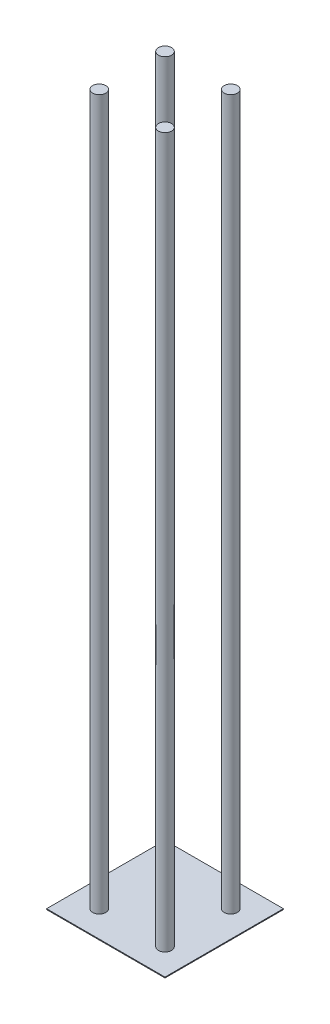
ISO-10303-21;
HEADER;
FILE_DESCRIPTION(('STEP AP214'),'2;1');
FILE_NAME('part.step','',(''),(''),'','','');
FILE_SCHEMA(('AUTOMOTIVE_DESIGN { 1 0 10303 214 1 1 1 1 }'));
ENDSEC;
DATA;
#1=APPLICATION_CONTEXT('core data for automotive mechanical design processes');
#2=APPLICATION_PROTOCOL_DEFINITION('international standard','automotive_design',2000,#1);
#3=PRODUCT_CONTEXT('',#1,'mechanical');
#4=PRODUCT('Part','Part','',(#3));
#5=PRODUCT_RELATED_PRODUCT_CATEGORY('part','',(#4));
#6=PRODUCT_DEFINITION_FORMATION('','',#4);
#7=PRODUCT_DEFINITION_CONTEXT('part definition',#1,'design');
#8=PRODUCT_DEFINITION('design','',#6,#7);
#9=PRODUCT_DEFINITION_SHAPE('','',#8);
#10=(LENGTH_UNIT() NAMED_UNIT(*) SI_UNIT(.MILLI.,.METRE.));
#11=(NAMED_UNIT(*) PLANE_ANGLE_UNIT() SI_UNIT($,.RADIAN.));
#12=(NAMED_UNIT(*) SI_UNIT($,.STERADIAN.) SOLID_ANGLE_UNIT());
#13=UNCERTAINTY_MEASURE_WITH_UNIT(LENGTH_MEASURE(1.E-05),#10,'distance_accuracy_value','');
#14=(GEOMETRIC_REPRESENTATION_CONTEXT(3) GLOBAL_UNCERTAINTY_ASSIGNED_CONTEXT((#13)) GLOBAL_UNIT_ASSIGNED_CONTEXT((#10,
#11,#12)) REPRESENTATION_CONTEXT('',''));
#15=CARTESIAN_POINT('',(0.,0.,0.));
#16=DIRECTION('',(0.,0.,1.));
#17=DIRECTION('',(1.,0.,0.));
#18=AXIS2_PLACEMENT_3D('',#15,#16,#17);
#19=CARTESIAN_POINT('',(-127.,0.,-127.));
#20=DIRECTION('',(0.,1.,0.));
#21=DIRECTION('',(0.,0.,1.));
#22=AXIS2_PLACEMENT_3D('',#19,#20,#21);
#23=PLANE('',#22);
#24=DIRECTION('',(0.,0.,1.));
#25=VECTOR('',#24,1.);
#26=CARTESIAN_POINT('',(-228.6,0.,-228.6));
#27=LINE('',#26,#25);
#28=CARTESIAN_POINT('',(-228.6,0.,-228.6));
#29=VERTEX_POINT('',#28);
#30=CARTESIAN_POINT('',(-228.6,0.,228.6));
#31=VERTEX_POINT('',#30);
#32=EDGE_CURVE('E106',#29,#31,#27,.T.);
#33=ORIENTED_EDGE('',*,*,#32,.F.);
#34=DIRECTION('',(-1.,0.,0.));
#35=VECTOR('',#34,1.);
#36=CARTESIAN_POINT('',(228.6,0.,-228.6));
#37=LINE('',#36,#35);
#38=CARTESIAN_POINT('',(228.6,0.,-228.6));
#39=VERTEX_POINT('',#38);
#40=EDGE_CURVE('E55',#39,#29,#37,.T.);
#41=ORIENTED_EDGE('',*,*,#40,.F.);
#42=DIRECTION('',(0.,0.,-1.));
#43=VECTOR('',#42,1.);
#44=CARTESIAN_POINT('',(228.6,0.,228.6));
#45=LINE('',#44,#43);
#46=CARTESIAN_POINT('',(228.6,0.,228.6));
#47=VERTEX_POINT('',#46);
#48=EDGE_CURVE('E57',#47,#39,#45,.T.);
#49=ORIENTED_EDGE('',*,*,#48,.F.);
#50=DIRECTION('',(1.,0.,0.));
#51=VECTOR('',#50,1.);
#52=CARTESIAN_POINT('',(-228.6,0.,228.6));
#53=LINE('',#52,#51);
#54=EDGE_CURVE('E59',#31,#47,#53,.T.);
#55=ORIENTED_EDGE('',*,*,#54,.F.);
#56=EDGE_LOOP('',(#33,#41,#49,#55));
#57=FACE_BOUND('',#56,.T.);
#58=ADVANCED_FACE('F17',(#57),#23,.F.);
#59=CARTESIAN_POINT('',(-127.,2743.2,-127.));
#60=DIRECTION('',(0.,1.,0.));
#61=DIRECTION('',(0.,0.,1.));
#62=AXIS2_PLACEMENT_3D('',#59,#60,#61);
#63=PLANE('',#62);
#64=CARTESIAN_POINT('',(-127.,2743.2,-127.));
#65=DIRECTION('',(0.,1.,0.));
#66=DIRECTION('',(0.,0.,1.));
#67=AXIS2_PLACEMENT_3D('',#64,#65,#66);
#68=CIRCLE('',#67,25.4);
#69=CARTESIAN_POINT('',(-127.,2743.2,-101.6));
#70=VERTEX_POINT('',#69);
#71=EDGE_CURVE('E20',#70,#70,#68,.F.);
#72=ORIENTED_EDGE('',*,*,#71,.F.);
#73=EDGE_LOOP('',(#72));
#74=FACE_BOUND('',#73,.T.);
#75=ADVANCED_FACE('F237',(#74),#63,.T.);
#76=CARTESIAN_POINT('',(127.,2743.2,127.));
#77=DIRECTION('',(0.,1.,0.));
#78=DIRECTION('',(0.,0.,1.));
#79=AXIS2_PLACEMENT_3D('',#76,#77,#78);
#80=PLANE('',#79);
#81=CARTESIAN_POINT('',(127.,2743.2,127.));
#82=DIRECTION('',(0.,1.,0.));
#83=DIRECTION('',(0.,0.,1.));
#84=AXIS2_PLACEMENT_3D('',#81,#82,#83);
#85=CIRCLE('',#84,25.4);
#86=CARTESIAN_POINT('',(127.,2743.2,152.4));
#87=VERTEX_POINT('',#86);
#88=EDGE_CURVE('E97',#87,#87,#85,.F.);
#89=ORIENTED_EDGE('',*,*,#88,.F.);
#90=EDGE_LOOP('',(#89));
#91=FACE_BOUND('',#90,.T.);
#92=ADVANCED_FACE('F228',(#91),#80,.T.);
#93=CARTESIAN_POINT('',(-127.,2743.2,127.));
#94=DIRECTION('',(0.,1.,0.));
#95=DIRECTION('',(0.,0.,1.));
#96=AXIS2_PLACEMENT_3D('',#93,#94,#95);
#97=PLANE('',#96);
#98=CARTESIAN_POINT('',(-127.,2743.2,127.));
#99=DIRECTION('',(0.,1.,0.));
#100=DIRECTION('',(0.,0.,1.));
#101=AXIS2_PLACEMENT_3D('',#98,#99,#100);
#102=CIRCLE('',#101,25.4);
#103=CARTESIAN_POINT('',(-127.,2743.2,152.4));
#104=VERTEX_POINT('',#103);
#105=EDGE_CURVE('E94',#104,#104,#102,.F.);
#106=ORIENTED_EDGE('',*,*,#105,.F.);
#107=EDGE_LOOP('',(#106));
#108=FACE_BOUND('',#107,.T.);
#109=ADVANCED_FACE('F220',(#108),#97,.T.);
#110=CARTESIAN_POINT('',(-228.6,0.,228.6));
#111=DIRECTION('',(0.,0.,1.));
#112=DIRECTION('',(1.,0.,0.));
#113=AXIS2_PLACEMENT_3D('',#110,#111,#112);
#114=PLANE('',#113);
#115=DIRECTION('',(1.,0.,0.));
#116=VECTOR('',#115,1.);
#117=CARTESIAN_POINT('',(0.,3.175,228.6));
#118=LINE('',#117,#116);
#119=CARTESIAN_POINT('',(-228.6,3.175,228.6));
#120=VERTEX_POINT('',#119);
#121=CARTESIAN_POINT('',(228.6,3.175,228.6));
#122=VERTEX_POINT('',#121);
#123=EDGE_CURVE('E96',#120,#122,#118,.T.);
#124=ORIENTED_EDGE('',*,*,#123,.F.);
#125=DIRECTION('',(0.,1.,0.));
#126=VECTOR('',#125,1.);
#127=CARTESIAN_POINT('',(-228.6,0.,228.6));
#128=LINE('',#127,#126);
#129=EDGE_CURVE('E70',#31,#120,#128,.T.);
#130=ORIENTED_EDGE('',*,*,#129,.F.);
#131=ORIENTED_EDGE('',*,*,#54,.T.);
#132=DIRECTION('',(0.,1.,0.));
#133=VECTOR('',#132,1.);
#134=CARTESIAN_POINT('',(228.6,0.,228.6));
#135=LINE('',#134,#133);
#136=EDGE_CURVE('E64',#122,#47,#135,.F.);
#137=ORIENTED_EDGE('',*,*,#136,.F.);
#138=EDGE_LOOP('',(#124,#130,#131,#137));
#139=FACE_BOUND('',#138,.T.);
#140=ADVANCED_FACE('F67',(#139),#114,.T.);
#141=CARTESIAN_POINT('',(228.6,0.,228.6));
#142=DIRECTION('',(1.,0.,0.));
#143=DIRECTION('',(0.,0.,-1.));
#144=AXIS2_PLACEMENT_3D('',#141,#142,#143);
#145=PLANE('',#144);
#146=DIRECTION('',(0.,0.,1.));
#147=VECTOR('',#146,1.);
#148=CARTESIAN_POINT('',(228.6,3.175,0.));
#149=LINE('',#148,#147);
#150=CARTESIAN_POINT('',(228.6,3.175,-228.6));
#151=VERTEX_POINT('',#150);
#152=EDGE_CURVE('E75',#122,#151,#149,.F.);
#153=ORIENTED_EDGE('',*,*,#152,.F.);
#154=ORIENTED_EDGE('',*,*,#136,.T.);
#155=ORIENTED_EDGE('',*,*,#48,.T.);
#156=DIRECTION('',(0.,1.,0.));
#157=VECTOR('',#156,1.);
#158=CARTESIAN_POINT('',(228.6,0.,-228.6));
#159=LINE('',#158,#157);
#160=EDGE_CURVE('E78',#151,#39,#159,.F.);
#161=ORIENTED_EDGE('',*,*,#160,.F.);
#162=EDGE_LOOP('',(#153,#154,#155,#161));
#163=FACE_BOUND('',#162,.T.);
#164=ADVANCED_FACE('F73',(#163),#145,.T.);
#165=CARTESIAN_POINT('',(228.6,0.,-228.6));
#166=DIRECTION('',(0.,0.,-1.));
#167=DIRECTION('',(-1.,0.,0.));
#168=AXIS2_PLACEMENT_3D('',#165,#166,#167);
#169=PLANE('',#168);
#170=DIRECTION('',(1.,0.,0.));
#171=VECTOR('',#170,1.);
#172=CARTESIAN_POINT('',(0.,3.175,-228.6));
#173=LINE('',#172,#171);
#174=CARTESIAN_POINT('',(-228.6,3.175,-228.6));
#175=VERTEX_POINT('',#174);
#176=EDGE_CURVE('E113',#151,#175,#173,.F.);
#177=ORIENTED_EDGE('',*,*,#176,.F.);
#178=ORIENTED_EDGE('',*,*,#160,.T.);
#179=ORIENTED_EDGE('',*,*,#40,.T.);
#180=DIRECTION('',(0.,1.,0.));
#181=VECTOR('',#180,1.);
#182=CARTESIAN_POINT('',(-228.6,0.,-228.6));
#183=LINE('',#182,#181);
#184=EDGE_CURVE('E35',#175,#29,#183,.F.);
#185=ORIENTED_EDGE('',*,*,#184,.F.);
#186=EDGE_LOOP('',(#177,#178,#179,#185));
#187=FACE_BOUND('',#186,.T.);
#188=ADVANCED_FACE('F111',(#187),#169,.T.);
#189=CARTESIAN_POINT('',(-228.6,0.,-228.6));
#190=DIRECTION('',(-1.,0.,0.));
#191=DIRECTION('',(0.,0.,1.));
#192=AXIS2_PLACEMENT_3D('',#189,#190,#191);
#193=PLANE('',#192);
#194=DIRECTION('',(0.,0.,1.));
#195=VECTOR('',#194,1.);
#196=CARTESIAN_POINT('',(-228.6,3.175,0.));
#197=LINE('',#196,#195);
#198=EDGE_CURVE('E93',#175,#120,#197,.T.);
#199=ORIENTED_EDGE('',*,*,#198,.F.);
#200=ORIENTED_EDGE('',*,*,#184,.T.);
#201=ORIENTED_EDGE('',*,*,#32,.T.);
#202=ORIENTED_EDGE('',*,*,#129,.T.);
#203=EDGE_LOOP('',(#199,#200,#201,#202));
#204=FACE_BOUND('',#203,.T.);
#205=ADVANCED_FACE('F119',(#204),#193,.T.);
#206=CARTESIAN_POINT('',(-127.,0.,-127.));
#207=DIRECTION('',(0.,1.,0.));
#208=DIRECTION('',(0.,0.,1.));
#209=AXIS2_PLACEMENT_3D('',#206,#207,#208);
#210=CYLINDRICAL_SURFACE('',#209,25.4);
#211=ORIENTED_EDGE('',*,*,#71,.T.);
#212=EDGE_LOOP('',(#211));
#213=FACE_BOUND('',#212,.T.);
#214=CARTESIAN_POINT('',(-127.,3.175,-127.));
#215=DIRECTION('',(0.,1.,0.));
#216=DIRECTION('',(0.,0.,1.));
#217=AXIS2_PLACEMENT_3D('',#214,#215,#216);
#218=CIRCLE('',#217,25.4);
#219=CARTESIAN_POINT('',(-127.,3.175,-101.6));
#220=VERTEX_POINT('',#219);
#221=EDGE_CURVE('E90',#220,#220,#218,.F.);
#222=ORIENTED_EDGE('',*,*,#221,.F.);
#223=EDGE_LOOP('',(#222));
#224=FACE_BOUND('',#223,.T.);
#225=ADVANCED_FACE('F121',(#213,#224),#210,.T.);
#226=CARTESIAN_POINT('',(127.,0.,127.));
#227=DIRECTION('',(0.,1.,0.));
#228=DIRECTION('',(0.,0.,1.));
#229=AXIS2_PLACEMENT_3D('',#226,#227,#228);
#230=CYLINDRICAL_SURFACE('',#229,25.4);
#231=ORIENTED_EDGE('',*,*,#88,.T.);
#232=EDGE_LOOP('',(#231));
#233=FACE_BOUND('',#232,.T.);
#234=CARTESIAN_POINT('',(127.,3.175,127.));
#235=DIRECTION('',(0.,1.,0.));
#236=DIRECTION('',(0.,0.,1.));
#237=AXIS2_PLACEMENT_3D('',#234,#235,#236);
#238=CIRCLE('',#237,25.4);
#239=CARTESIAN_POINT('',(127.,3.175,152.4));
#240=VERTEX_POINT('',#239);
#241=EDGE_CURVE('E87',#240,#240,#238,.F.);
#242=ORIENTED_EDGE('',*,*,#241,.F.);
#243=EDGE_LOOP('',(#242));
#244=FACE_BOUND('',#243,.T.);
#245=ADVANCED_FACE('F128',(#233,#244),#230,.T.);
#246=CARTESIAN_POINT('',(-127.,0.,127.));
#247=DIRECTION('',(0.,1.,0.));
#248=DIRECTION('',(0.,0.,1.));
#249=AXIS2_PLACEMENT_3D('',#246,#247,#248);
#250=CYLINDRICAL_SURFACE('',#249,25.4);
#251=ORIENTED_EDGE('',*,*,#105,.T.);
#252=EDGE_LOOP('',(#251));
#253=FACE_BOUND('',#252,.T.);
#254=CARTESIAN_POINT('',(-127.,3.175,127.));
#255=DIRECTION('',(0.,1.,0.));
#256=DIRECTION('',(0.,0.,1.));
#257=AXIS2_PLACEMENT_3D('',#254,#255,#256);
#258=CIRCLE('',#257,25.4);
#259=CARTESIAN_POINT('',(-127.,3.175,152.4));
#260=VERTEX_POINT('',#259);
#261=EDGE_CURVE('E84',#260,#260,#258,.F.);
#262=ORIENTED_EDGE('',*,*,#261,.F.);
#263=EDGE_LOOP('',(#262));
#264=FACE_BOUND('',#263,.T.);
#265=ADVANCED_FACE('F145',(#253,#264),#250,.T.);
#266=CARTESIAN_POINT('',(0.,3.175,0.));
#267=DIRECTION('',(0.,1.,0.));
#268=DIRECTION('',(0.,0.,1.));
#269=AXIS2_PLACEMENT_3D('',#266,#267,#268);
#270=PLANE('',#269);
#271=CARTESIAN_POINT('',(127.,3.175,-127.));
#272=DIRECTION('',(0.,1.,0.));
#273=DIRECTION('',(0.,0.,1.));
#274=AXIS2_PLACEMENT_3D('',#271,#272,#273);
#275=CIRCLE('',#274,25.4);
#276=CARTESIAN_POINT('',(127.,3.175,-101.6));
#277=VERTEX_POINT('',#276);
#278=EDGE_CURVE('E26',#277,#277,#275,.T.);
#279=ORIENTED_EDGE('',*,*,#278,.F.);
#280=EDGE_LOOP('',(#279));
#281=FACE_BOUND('',#280,.T.);
#282=ORIENTED_EDGE('',*,*,#261,.T.);
#283=EDGE_LOOP('',(#282));
#284=FACE_BOUND('',#283,.T.);
#285=ORIENTED_EDGE('',*,*,#241,.T.);
#286=EDGE_LOOP('',(#285));
#287=FACE_BOUND('',#286,.T.);
#288=ORIENTED_EDGE('',*,*,#221,.T.);
#289=EDGE_LOOP('',(#288));
#290=FACE_BOUND('',#289,.T.);
#291=ORIENTED_EDGE('',*,*,#176,.T.);
#292=ORIENTED_EDGE('',*,*,#198,.T.);
#293=ORIENTED_EDGE('',*,*,#123,.T.);
#294=ORIENTED_EDGE('',*,*,#152,.T.);
#295=EDGE_LOOP('',(#291,#292,#293,#294));
#296=FACE_BOUND('',#295,.T.);
#297=ADVANCED_FACE('F117',(#281,#284,#287,#290,#296),#270,.T.);
#298=CARTESIAN_POINT('',(127.,2743.2,-127.));
#299=DIRECTION('',(0.,1.,0.));
#300=DIRECTION('',(0.,0.,1.));
#301=AXIS2_PLACEMENT_3D('',#298,#299,#300);
#302=PLANE('',#301);
#303=CARTESIAN_POINT('',(127.,2743.2,-127.));
#304=DIRECTION('',(0.,1.,0.));
#305=DIRECTION('',(0.,0.,1.));
#306=AXIS2_PLACEMENT_3D('',#303,#304,#305);
#307=CIRCLE('',#306,25.4);
#308=CARTESIAN_POINT('',(127.,2743.2,-101.6));
#309=VERTEX_POINT('',#308);
#310=EDGE_CURVE('E11',#309,#309,#307,.F.);
#311=ORIENTED_EDGE('',*,*,#310,.F.);
#312=EDGE_LOOP('',(#311));
#313=FACE_BOUND('',#312,.T.);
#314=ADVANCED_FACE('F133',(#313),#302,.T.);
#315=CARTESIAN_POINT('',(127.,0.,-127.));
#316=DIRECTION('',(0.,1.,0.));
#317=DIRECTION('',(0.,0.,1.));
#318=AXIS2_PLACEMENT_3D('',#315,#316,#317);
#319=CYLINDRICAL_SURFACE('',#318,25.4);
#320=ORIENTED_EDGE('',*,*,#310,.T.);
#321=EDGE_LOOP('',(#320));
#322=FACE_BOUND('',#321,.T.);
#323=ORIENTED_EDGE('',*,*,#278,.T.);
#324=EDGE_LOOP('',(#323));
#325=FACE_BOUND('',#324,.T.);
#326=ADVANCED_FACE('F131',(#322,#325),#319,.T.);
#327=CLOSED_SHELL('',(#58,#75,#92,#109,#140,#164,#188,#205,#225,#245,#265,#297,#314,#326));
#328=MANIFOLD_SOLID_BREP('B1',#327);
#329=ADVANCED_BREP_SHAPE_REPRESENTATION('',(#18,#328),#14);
#330=SHAPE_DEFINITION_REPRESENTATION(#9,#329);
ENDSEC;
END-ISO-10303-21;
